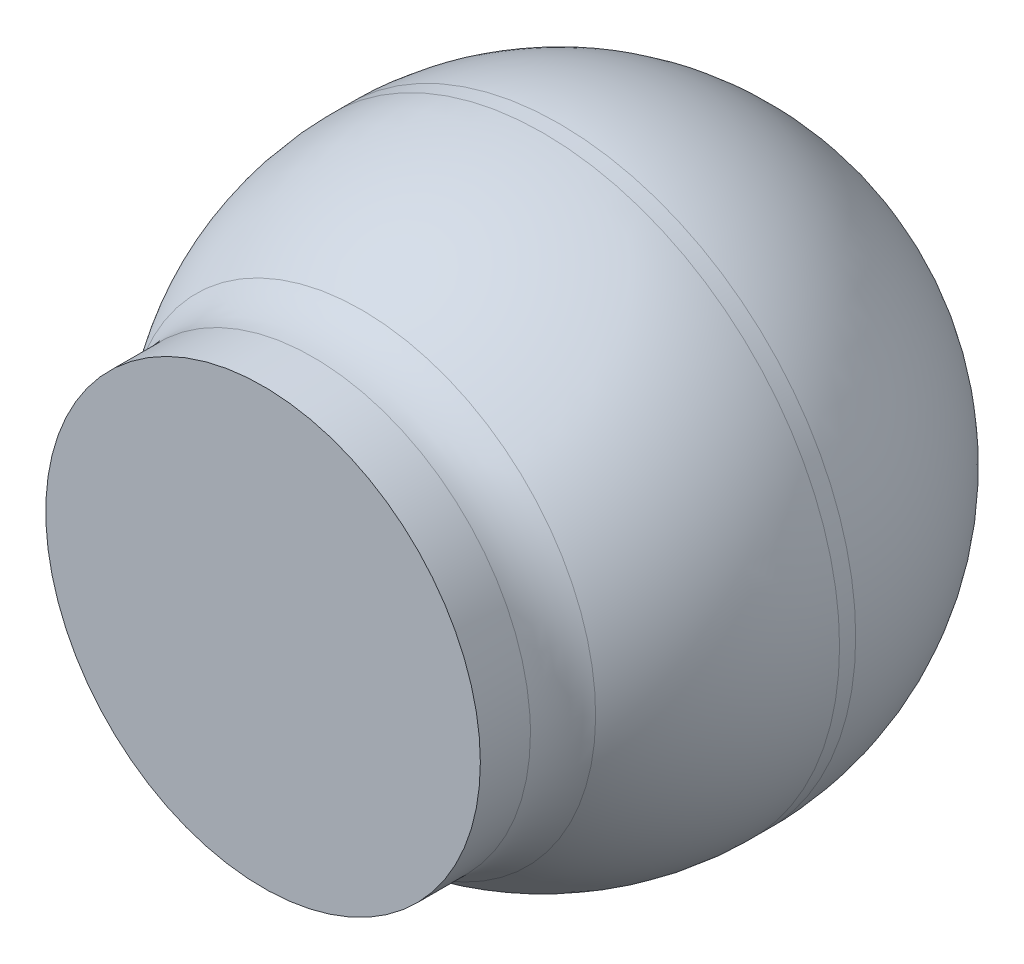
ISO-10303-21;
HEADER;
FILE_DESCRIPTION(('STEP AP214'),'2;1');
FILE_NAME('part.step','',(''),(''),'','','');
FILE_SCHEMA(('AUTOMOTIVE_DESIGN { 1 0 10303 214 1 1 1 1 }'));
ENDSEC;
DATA;
#1=APPLICATION_CONTEXT('core data for automotive mechanical design processes');
#2=APPLICATION_PROTOCOL_DEFINITION('international standard','automotive_design',2000,#1);
#3=PRODUCT_CONTEXT('',#1,'mechanical');
#4=PRODUCT('Part','Part','',(#3));
#5=PRODUCT_RELATED_PRODUCT_CATEGORY('part','',(#4));
#6=PRODUCT_DEFINITION_FORMATION('','',#4);
#7=PRODUCT_DEFINITION_CONTEXT('part definition',#1,'design');
#8=PRODUCT_DEFINITION('design','',#6,#7);
#9=PRODUCT_DEFINITION_SHAPE('','',#8);
#10=(LENGTH_UNIT() NAMED_UNIT(*) SI_UNIT(.MILLI.,.METRE.));
#11=(NAMED_UNIT(*) PLANE_ANGLE_UNIT() SI_UNIT($,.RADIAN.));
#12=(NAMED_UNIT(*) SI_UNIT($,.STERADIAN.) SOLID_ANGLE_UNIT());
#13=UNCERTAINTY_MEASURE_WITH_UNIT(LENGTH_MEASURE(1.E-05),#10,'distance_accuracy_value','');
#14=(GEOMETRIC_REPRESENTATION_CONTEXT(3) GLOBAL_UNCERTAINTY_ASSIGNED_CONTEXT((#13)) GLOBAL_UNIT_ASSIGNED_CONTEXT((#10,
#11,#12)) REPRESENTATION_CONTEXT('',''));
#15=CARTESIAN_POINT('',(0.,0.,0.));
#16=DIRECTION('',(0.,0.,1.));
#17=DIRECTION('',(1.,0.,0.));
#18=AXIS2_PLACEMENT_3D('',#15,#16,#17);
#19=CARTESIAN_POINT('',(1.977080077731,-1.511349291452,10.006534503384));
#20=DIRECTION('',(0.,0.,-1.));
#21=DIRECTION('',(-1.,0.,0.));
#22=AXIS2_PLACEMENT_3D('',#19,#20,#21);
#23=PLANE('',#22);
#24=CARTESIAN_POINT('',(1.977080077731,-1.511349291452,10.006534503384));
#25=DIRECTION('',(0.,0.,1.));
#26=DIRECTION('',(1.,0.,0.));
#27=AXIS2_PLACEMENT_3D('',#24,#25,#26);
#28=CIRCLE('',#27,0.275);
#29=CARTESIAN_POINT('',(2.252080077731,-1.511349291452,10.006534503384));
#30=VERTEX_POINT('',#29);
#31=EDGE_CURVE('E20',#30,#30,#28,.F.);
#32=ORIENTED_EDGE('',*,*,#31,.F.);
#33=EDGE_LOOP('',(#32));
#34=FACE_BOUND('',#33,.T.);
#35=ADVANCED_FACE('F17',(#34),#23,.F.);
#36=CARTESIAN_POINT('',(1.977080077731,-1.511349291452,9.906534503384));
#37=DIRECTION('',(0.,0.,1.));
#38=DIRECTION('',(1.,0.,0.));
#39=AXIS2_PLACEMENT_3D('',#36,#37,#38);
#40=CYLINDRICAL_SURFACE('',#39,0.275);
#41=CARTESIAN_POINT('',(1.977080077731,-1.511349291452,9.943180457728));
#42=DIRECTION('',(0.,0.,-1.));
#43=DIRECTION('',(0.996700902337582,0.0811622527992462,0.));
#44=AXIS2_PLACEMENT_3D('',#41,#42,#43);
#45=CIRCLE('',#44,0.275);
#46=CARTESIAN_POINT('',(2.25117282587384,-1.48902967193221,9.943180457728));
#47=VERTEX_POINT('',#46);
#48=EDGE_CURVE('E65',#47,#47,#45,.F.);
#49=ORIENTED_EDGE('',*,*,#48,.T.);
#50=EDGE_LOOP('',(#49));
#51=FACE_BOUND('',#50,.T.);
#52=ORIENTED_EDGE('',*,*,#31,.T.);
#53=EDGE_LOOP('',(#52));
#54=FACE_BOUND('',#53,.T.);
#55=ADVANCED_FACE('F62',(#51,#54),#40,.T.);
#56=CARTESIAN_POINT('',(1.977080077731,-1.511349291452,9.943180457728));
#57=DIRECTION('',(0.,0.,-1.));
#58=DIRECTION('',(0.996700902337583,0.081162252799246,0.));
#59=AXIS2_PLACEMENT_3D('',#56,#57,#58);
#60=TOROIDAL_SURFACE('',#59,0.375,0.1);
#61=ORIENTED_EDGE('',*,*,#48,.F.);
#62=EDGE_LOOP('',(#61));
#63=FACE_BOUND('',#62,.T.);
#64=CARTESIAN_POINT('',(1.977080077731,-1.511349291452,9.881744931236));
#65=DIRECTION('',(0.,0.,-1.));
#66=DIRECTION('',(-0.996700902337597,-0.0811622527990614,0.));
#67=AXIS2_PLACEMENT_3D('',#64,#65,#66);
#68=CIRCLE('',#67,0.296097046412665);
#69=CARTESIAN_POINT('',(1.681959884392,-1.535381194786,9.881744931236));
#70=VERTEX_POINT('',#69);
#71=EDGE_CURVE('E39',#70,#70,#68,.T.);
#72=ORIENTED_EDGE('',*,*,#71,.F.);
#73=EDGE_LOOP('',(#72));
#74=FACE_BOUND('',#73,.T.);
#75=ADVANCED_FACE('F57',(#63,#74),#60,.F.);
#76=CARTESIAN_POINT('',(1.603317239355,-1.541785136252,9.651976062157));
#77=CARTESIAN_POINT('',(1.603317239355,-1.541785136252,9.701461392103));
#78=CARTESIAN_POINT('',(1.611473782652,-1.541120941579,9.750947004335));
#79=CARTESIAN_POINT('',(1.627792914651,-1.539792059952,9.798626332798));
#80=CARTESIAN_POINT('',(1.651658609162,-1.537848654938,9.842699544317));
#81=CARTESIAN_POINT('',(1.681959884392,-1.535381194786,9.881744931236));
#82=(BOUNDED_CURVE() B_SPLINE_CURVE(5,(#76,#77,#78,#79,#80,#81),.UNSPECIFIED.,.F.,
.F.) B_SPLINE_CURVE_WITH_KNOTS((6,6),(0.,0.661568582165),
.UNSPECIFIED.) CURVE() GEOMETRIC_REPRESENTATION_ITEM() RATIONAL_B_SPLINE_CURVE((1.,1.,1.,1.,1.,1.)) REPRESENTATION_ITEM(''));
#83=CARTESIAN_POINT('',(1.977080077731,-1.511349291452,9.651976062157));
#84=DIRECTION('',(0.,0.,-1.));
#85=AXIS1_PLACEMENT('',#83,#84);
#86=SURFACE_OF_REVOLUTION('',#82,#85);
#87=CARTESIAN_POINT('',(1.977080077731,-1.511349291452,9.651976062157));
#88=DIRECTION('',(0.,0.,1.));
#89=DIRECTION('',(1.,0.,0.));
#90=AXIS2_PLACEMENT_3D('',#87,#88,#89);
#91=CIRCLE('',#90,0.375);
#92=CARTESIAN_POINT('',(2.352080077731,-1.511349291452,9.651976062157));
#93=VERTEX_POINT('',#92);
#94=EDGE_CURVE('E36',#93,#93,#91,.F.);
#95=ORIENTED_EDGE('',*,*,#94,.F.);
#96=EDGE_LOOP('',(#95));
#97=FACE_BOUND('',#96,.T.);
#98=ORIENTED_EDGE('',*,*,#71,.T.);
#99=EDGE_LOOP('',(#98));
#100=FACE_BOUND('',#99,.T.);
#101=ADVANCED_FACE('F53',(#97,#100),#86,.F.);
#102=CARTESIAN_POINT('',(1.977080077731,-1.511349291452,9.256534503384));
#103=DIRECTION('',(0.,0.,1.));
#104=DIRECTION('',(1.,0.,0.));
#105=AXIS2_PLACEMENT_3D('',#102,#103,#104);
#106=CYLINDRICAL_SURFACE('',#105,0.375);
#107=CARTESIAN_POINT('',(1.977080077731,-1.511349291452,9.631534503384));
#108=DIRECTION('',(0.,0.,-1.));
#109=DIRECTION('',(0.0811622527992356,-0.996700902337583,0.));
#110=AXIS2_PLACEMENT_3D('',#107,#108,#109);
#111=CIRCLE('',#110,0.375);
#112=CARTESIAN_POINT('',(2.00751592253071,-1.88511212982859,9.631534503384));
#113=VERTEX_POINT('',#112);
#114=CARTESIAN_POINT('',(1.94664423293129,-1.13758645307541,9.631534503384));
#115=VERTEX_POINT('',#114);
#116=EDGE_CURVE('E11',#113,#115,#111,.T.);
#117=ORIENTED_EDGE('',*,*,#116,.F.);
#118=CARTESIAN_POINT('',(1.977080077731,-1.511349291452,9.631534503384));
#119=DIRECTION('',(0.,0.,1.));
#120=DIRECTION('',(0.0811622527992365,-0.996700902337583,0.));
#121=AXIS2_PLACEMENT_3D('',#118,#119,#120);
#122=CIRCLE('',#121,0.375);
#123=EDGE_CURVE('E25',#115,#113,#122,.F.);
#124=ORIENTED_EDGE('',*,*,#123,.F.);
#125=EDGE_LOOP('',(#117,#124));
#126=FACE_BOUND('',#125,.T.);
#127=ORIENTED_EDGE('',*,*,#94,.T.);
#128=EDGE_LOOP('',(#127));
#129=FACE_BOUND('',#128,.T.);
#130=ADVANCED_FACE('F34',(#126,#129),#106,.T.);
#131=CARTESIAN_POINT('',(1.977080077731,-1.511349291452,9.631534503384));
#132=DIRECTION('',(0.0811622527992361,-0.996700902337583,0.));
#133=DIRECTION('',(-0.996700902337583,-0.0811622527992361,0.));
#134=AXIS2_PLACEMENT_3D('',#131,#132,#133);
#135=SPHERICAL_SURFACE('',#134,0.375);
#136=ORIENTED_EDGE('',*,*,#123,.T.);
#137=ORIENTED_EDGE('',*,*,#116,.T.);
#138=EDGE_LOOP('',(#136,#137));
#139=FACE_BOUND('',#138,.T.);
#140=ADVANCED_FACE('F32',(#139),#135,.T.);
#141=CLOSED_SHELL('',(#35,#55,#75,#101,#130,#140));
#142=MANIFOLD_SOLID_BREP('B1',#141);
#143=ADVANCED_BREP_SHAPE_REPRESENTATION('',(#18,#142),#14);
#144=SHAPE_DEFINITION_REPRESENTATION(#9,#143);
ENDSEC;
END-ISO-10303-21;
